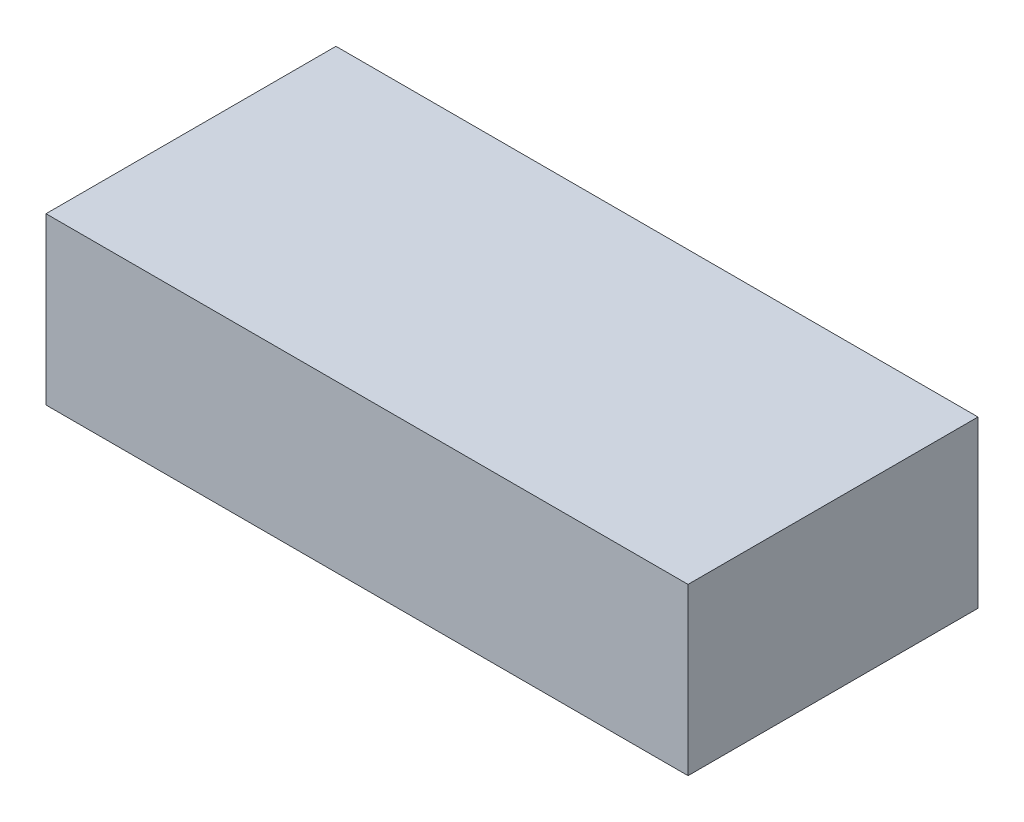
ISO-10303-21;
HEADER;
FILE_DESCRIPTION(('STEP AP214'),'2;1');
FILE_NAME('part.step','',(''),(''),'','','');
FILE_SCHEMA(('AUTOMOTIVE_DESIGN { 1 0 10303 214 1 1 1 1 }'));
ENDSEC;
DATA;
#1=APPLICATION_CONTEXT('core data for automotive mechanical design processes');
#2=APPLICATION_PROTOCOL_DEFINITION('international standard','automotive_design',2000,#1);
#3=PRODUCT_CONTEXT('',#1,'mechanical');
#4=PRODUCT('Part','Part','',(#3));
#5=PRODUCT_RELATED_PRODUCT_CATEGORY('part','',(#4));
#6=PRODUCT_DEFINITION_FORMATION('','',#4);
#7=PRODUCT_DEFINITION_CONTEXT('part definition',#1,'design');
#8=PRODUCT_DEFINITION('design','',#6,#7);
#9=PRODUCT_DEFINITION_SHAPE('','',#8);
#10=(LENGTH_UNIT() NAMED_UNIT(*) SI_UNIT(.MILLI.,.METRE.));
#11=(NAMED_UNIT(*) PLANE_ANGLE_UNIT() SI_UNIT($,.RADIAN.));
#12=(NAMED_UNIT(*) SI_UNIT($,.STERADIAN.) SOLID_ANGLE_UNIT());
#13=UNCERTAINTY_MEASURE_WITH_UNIT(LENGTH_MEASURE(1.E-05),#10,'distance_accuracy_value','');
#14=(GEOMETRIC_REPRESENTATION_CONTEXT(3) GLOBAL_UNCERTAINTY_ASSIGNED_CONTEXT((#13)) GLOBAL_UNIT_ASSIGNED_CONTEXT((#10,
#11,#12)) REPRESENTATION_CONTEXT('',''));
#15=CARTESIAN_POINT('',(0.,0.,0.));
#16=DIRECTION('',(0.,0.,1.));
#17=DIRECTION('',(1.,0.,0.));
#18=AXIS2_PLACEMENT_3D('',#15,#16,#17);
#19=CARTESIAN_POINT('',(98.425,25.4,44.45));
#20=DIRECTION('',(-1.,0.,0.));
#21=DIRECTION('',(0.,0.,1.));
#22=AXIS2_PLACEMENT_3D('',#19,#20,#21);
#23=PLANE('',#22);
#24=DIRECTION('',(0.,0.,-1.));
#25=VECTOR('',#24,1.);
#26=CARTESIAN_POINT('',(98.425,-25.4,44.45));
#27=LINE('',#26,#25);
#28=CARTESIAN_POINT('',(98.425,-25.4,44.45));
#29=VERTEX_POINT('',#28);
#30=CARTESIAN_POINT('',(98.425,-25.4,-44.45));
#31=VERTEX_POINT('',#30);
#32=EDGE_CURVE('E111',#29,#31,#27,.T.);
#33=ORIENTED_EDGE('',*,*,#32,.T.);
#34=DIRECTION('',(0.,-1.,0.));
#35=VECTOR('',#34,1.);
#36=CARTESIAN_POINT('',(98.425,25.4,-44.45));
#37=LINE('',#36,#35);
#38=CARTESIAN_POINT('',(98.425,25.4,-44.45));
#39=VERTEX_POINT('',#38);
#40=EDGE_CURVE('E11',#39,#31,#37,.T.);
#41=ORIENTED_EDGE('',*,*,#40,.F.);
#42=DIRECTION('',(0.,0.,-1.));
#43=VECTOR('',#42,1.);
#44=CARTESIAN_POINT('',(98.425,25.4,44.45));
#45=LINE('',#44,#43);
#46=CARTESIAN_POINT('',(98.425,25.4,44.45));
#47=VERTEX_POINT('',#46);
#48=EDGE_CURVE('E95',#47,#39,#45,.T.);
#49=ORIENTED_EDGE('',*,*,#48,.F.);
#50=DIRECTION('',(0.,-1.,0.));
#51=VECTOR('',#50,1.);
#52=CARTESIAN_POINT('',(98.425,25.4,44.45));
#53=LINE('',#52,#51);
#54=EDGE_CURVE('E107',#47,#29,#53,.T.);
#55=ORIENTED_EDGE('',*,*,#54,.T.);
#56=EDGE_LOOP('',(#33,#41,#49,#55));
#57=FACE_BOUND('',#56,.T.);
#58=ADVANCED_FACE('F43',(#57),#23,.F.);
#59=CARTESIAN_POINT('',(-98.425,25.4,-44.45));
#60=DIRECTION('',(0.,0.,1.));
#61=DIRECTION('',(1.,0.,0.));
#62=AXIS2_PLACEMENT_3D('',#59,#60,#61);
#63=PLANE('',#62);
#64=DIRECTION('',(-1.,0.,0.));
#65=VECTOR('',#64,1.);
#66=CARTESIAN_POINT('',(-98.425,-25.4,-44.45));
#67=LINE('',#66,#65);
#68=CARTESIAN_POINT('',(-98.425,-25.4,-44.45));
#69=VERTEX_POINT('',#68);
#70=EDGE_CURVE('E100',#31,#69,#67,.T.);
#71=ORIENTED_EDGE('',*,*,#70,.T.);
#72=DIRECTION('',(0.,-1.,0.));
#73=VECTOR('',#72,1.);
#74=CARTESIAN_POINT('',(-98.425,25.4,-44.45));
#75=LINE('',#74,#73);
#76=CARTESIAN_POINT('',(-98.425,25.4,-44.45));
#77=VERTEX_POINT('',#76);
#78=EDGE_CURVE('E52',#77,#69,#75,.T.);
#79=ORIENTED_EDGE('',*,*,#78,.F.);
#80=DIRECTION('',(-1.,0.,0.));
#81=VECTOR('',#80,1.);
#82=CARTESIAN_POINT('',(-98.425,25.4,-44.45));
#83=LINE('',#82,#81);
#84=EDGE_CURVE('E90',#39,#77,#83,.T.);
#85=ORIENTED_EDGE('',*,*,#84,.F.);
#86=ORIENTED_EDGE('',*,*,#40,.T.);
#87=EDGE_LOOP('',(#71,#79,#85,#86));
#88=FACE_BOUND('',#87,.T.);
#89=ADVANCED_FACE('F99',(#88),#63,.F.);
#90=CARTESIAN_POINT('',(-98.425,25.4,44.45));
#91=DIRECTION('',(1.,0.,0.));
#92=DIRECTION('',(0.,0.,-1.));
#93=AXIS2_PLACEMENT_3D('',#90,#91,#92);
#94=PLANE('',#93);
#95=DIRECTION('',(0.,0.,1.));
#96=VECTOR('',#95,1.);
#97=CARTESIAN_POINT('',(-98.425,-25.4,44.45));
#98=LINE('',#97,#96);
#99=CARTESIAN_POINT('',(-98.425,-25.4,44.45));
#100=VERTEX_POINT('',#99);
#101=EDGE_CURVE('E77',#69,#100,#98,.T.);
#102=ORIENTED_EDGE('',*,*,#101,.T.);
#103=DIRECTION('',(0.,-1.,0.));
#104=VECTOR('',#103,1.);
#105=CARTESIAN_POINT('',(-98.425,25.4,44.45));
#106=LINE('',#105,#104);
#107=CARTESIAN_POINT('',(-98.425,25.4,44.45));
#108=VERTEX_POINT('',#107);
#109=EDGE_CURVE('E102',#108,#100,#106,.T.);
#110=ORIENTED_EDGE('',*,*,#109,.F.);
#111=DIRECTION('',(0.,0.,1.));
#112=VECTOR('',#111,1.);
#113=CARTESIAN_POINT('',(-98.425,25.4,44.45));
#114=LINE('',#113,#112);
#115=EDGE_CURVE('E93',#77,#108,#114,.T.);
#116=ORIENTED_EDGE('',*,*,#115,.F.);
#117=ORIENTED_EDGE('',*,*,#78,.T.);
#118=EDGE_LOOP('',(#102,#110,#116,#117));
#119=FACE_BOUND('',#118,.T.);
#120=ADVANCED_FACE('F103',(#119),#94,.F.);
#121=CARTESIAN_POINT('',(-98.425,25.4,44.45));
#122=DIRECTION('',(0.,0.,-1.));
#123=DIRECTION('',(-1.,0.,0.));
#124=AXIS2_PLACEMENT_3D('',#121,#122,#123);
#125=PLANE('',#124);
#126=DIRECTION('',(1.,0.,0.));
#127=VECTOR('',#126,1.);
#128=CARTESIAN_POINT('',(-98.425,-25.4,44.45));
#129=LINE('',#128,#127);
#130=EDGE_CURVE('E83',#100,#29,#129,.T.);
#131=ORIENTED_EDGE('',*,*,#130,.T.);
#132=ORIENTED_EDGE('',*,*,#54,.F.);
#133=DIRECTION('',(1.,0.,0.));
#134=VECTOR('',#133,1.);
#135=CARTESIAN_POINT('',(-98.425,25.4,44.45));
#136=LINE('',#135,#134);
#137=EDGE_CURVE('E60',#108,#47,#136,.T.);
#138=ORIENTED_EDGE('',*,*,#137,.F.);
#139=ORIENTED_EDGE('',*,*,#109,.T.);
#140=EDGE_LOOP('',(#131,#132,#138,#139));
#141=FACE_BOUND('',#140,.T.);
#142=ADVANCED_FACE('F124',(#141),#125,.F.);
#143=CARTESIAN_POINT('',(0.,25.4,0.));
#144=DIRECTION('',(0.,-1.,0.));
#145=DIRECTION('',(0.,0.,-1.));
#146=AXIS2_PLACEMENT_3D('',#143,#144,#145);
#147=PLANE('',#146);
#148=ORIENTED_EDGE('',*,*,#48,.T.);
#149=ORIENTED_EDGE('',*,*,#84,.T.);
#150=ORIENTED_EDGE('',*,*,#115,.T.);
#151=ORIENTED_EDGE('',*,*,#137,.T.);
#152=EDGE_LOOP('',(#148,#149,#150,#151));
#153=FACE_BOUND('',#152,.T.);
#154=ADVANCED_FACE('F91',(#153),#147,.F.);
#155=CARTESIAN_POINT('',(0.,-25.4,0.));
#156=DIRECTION('',(0.,-1.,0.));
#157=DIRECTION('',(0.,0.,-1.));
#158=AXIS2_PLACEMENT_3D('',#155,#156,#157);
#159=PLANE('',#158);
#160=ORIENTED_EDGE('',*,*,#32,.F.);
#161=ORIENTED_EDGE('',*,*,#130,.F.);
#162=ORIENTED_EDGE('',*,*,#101,.F.);
#163=ORIENTED_EDGE('',*,*,#70,.F.);
#164=EDGE_LOOP('',(#160,#161,#162,#163));
#165=FACE_BOUND('',#164,.T.);
#166=ADVANCED_FACE('F127',(#165),#159,.T.);
#167=CLOSED_SHELL('',(#58,#89,#120,#142,#154,#166));
#168=MANIFOLD_SOLID_BREP('B2',#167);
#169=ADVANCED_BREP_SHAPE_REPRESENTATION('',(#18,#168),#14);
#170=SHAPE_DEFINITION_REPRESENTATION(#9,#169);
ENDSEC;
END-ISO-10303-21;
